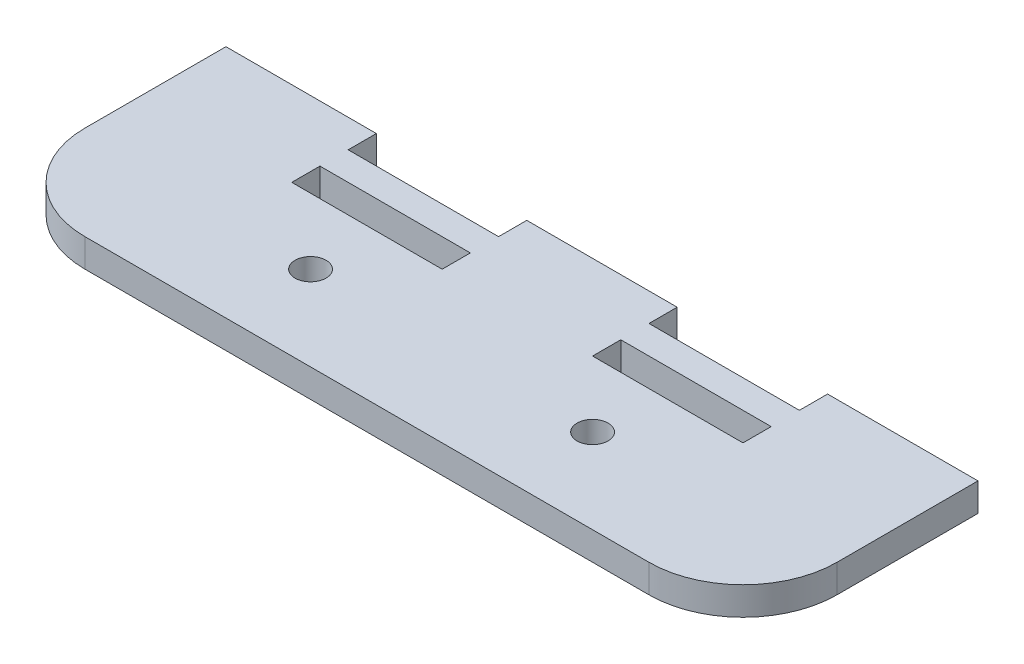
ISO-10303-21;
HEADER;
FILE_DESCRIPTION(('STEP AP214'),'2;1');
FILE_NAME('part.step','',(''),(''),'','','');
FILE_SCHEMA(('AUTOMOTIVE_DESIGN { 1 0 10303 214 1 1 1 1 }'));
ENDSEC;
DATA;
#1=APPLICATION_CONTEXT('core data for automotive mechanical design processes');
#2=APPLICATION_PROTOCOL_DEFINITION('international standard','automotive_design',2000,#1);
#3=PRODUCT_CONTEXT('',#1,'mechanical');
#4=PRODUCT('Part','Part','',(#3));
#5=PRODUCT_RELATED_PRODUCT_CATEGORY('part','',(#4));
#6=PRODUCT_DEFINITION_FORMATION('','',#4);
#7=PRODUCT_DEFINITION_CONTEXT('part definition',#1,'design');
#8=PRODUCT_DEFINITION('design','',#6,#7);
#9=PRODUCT_DEFINITION_SHAPE('','',#8);
#10=(LENGTH_UNIT() NAMED_UNIT(*) SI_UNIT(.MILLI.,.METRE.));
#11=(NAMED_UNIT(*) PLANE_ANGLE_UNIT() SI_UNIT($,.RADIAN.));
#12=(NAMED_UNIT(*) SI_UNIT($,.STERADIAN.) SOLID_ANGLE_UNIT());
#13=UNCERTAINTY_MEASURE_WITH_UNIT(LENGTH_MEASURE(1.E-05),#10,'distance_accuracy_value','');
#14=(GEOMETRIC_REPRESENTATION_CONTEXT(3) GLOBAL_UNCERTAINTY_ASSIGNED_CONTEXT((#13)) GLOBAL_UNIT_ASSIGNED_CONTEXT((#10,
#11,#12)) REPRESENTATION_CONTEXT('',''));
#15=CARTESIAN_POINT('',(0.,0.,0.));
#16=DIRECTION('',(0.,0.,1.));
#17=DIRECTION('',(1.,0.,0.));
#18=AXIS2_PLACEMENT_3D('',#15,#16,#17);
#19=CARTESIAN_POINT('',(-30.,3.,2.50000000000001));
#20=DIRECTION('',(0.,1.,0.));
#21=DIRECTION('',(0.,0.,1.));
#22=AXIS2_PLACEMENT_3D('',#19,#20,#21);
#23=PLANE('',#22);
#24=CARTESIAN_POINT('',(-15.,3.,3.5));
#25=DIRECTION('',(0.,1.,0.));
#26=DIRECTION('',(0.,0.,1.));
#27=AXIS2_PLACEMENT_3D('',#24,#25,#26);
#28=CIRCLE('',#27,1.65);
#29=CARTESIAN_POINT('',(-15.,3.,5.15));
#30=VERTEX_POINT('',#29);
#31=EDGE_CURVE('E257',#30,#30,#28,.T.);
#32=ORIENTED_EDGE('',*,*,#31,.F.);
#33=EDGE_LOOP('',(#32));
#34=FACE_BOUND('',#33,.T.);
#35=DIRECTION('',(-1.,0.,0.));
#36=VECTOR('',#35,1.);
#37=CARTESIAN_POINT('',(-24.,3.,-12.5));
#38=LINE('',#37,#36);
#39=CARTESIAN_POINT('',(-24.,3.,-12.5));
#40=VERTEX_POINT('',#39);
#41=CARTESIAN_POINT('',(-40.,3.,-12.5));
#42=VERTEX_POINT('',#41);
#43=EDGE_CURVE('E263',#40,#42,#38,.T.);
#44=ORIENTED_EDGE('',*,*,#43,.T.);
#45=DIRECTION('',(0.,0.,1.));
#46=VECTOR('',#45,1.);
#47=CARTESIAN_POINT('',(-40.,3.,2.49999999999994));
#48=LINE('',#47,#46);
#49=CARTESIAN_POINT('',(-40.,3.,2.49999999999994));
#50=VERTEX_POINT('',#49);
#51=EDGE_CURVE('E266',#42,#50,#48,.T.);
#52=ORIENTED_EDGE('',*,*,#51,.T.);
#53=CARTESIAN_POINT('',(-30.,3.,2.50000000000001));
#54=DIRECTION('',(0.,1.,0.));
#55=DIRECTION('',(0.,0.,1.));
#56=AXIS2_PLACEMENT_3D('',#53,#54,#55);
#57=CIRCLE('',#56,10.);
#58=CARTESIAN_POINT('',(-30.,3.,12.5));
#59=VERTEX_POINT('',#58);
#60=EDGE_CURVE('E269',#50,#59,#57,.T.);
#61=ORIENTED_EDGE('',*,*,#60,.T.);
#62=DIRECTION('',(1.,0.,0.));
#63=VECTOR('',#62,1.);
#64=CARTESIAN_POINT('',(29.9999999999999,3.,12.5));
#65=LINE('',#64,#63);
#66=CARTESIAN_POINT('',(29.9999999999999,3.,12.5));
#67=VERTEX_POINT('',#66);
#68=EDGE_CURVE('E271',#59,#67,#65,.T.);
#69=ORIENTED_EDGE('',*,*,#68,.T.);
#70=CARTESIAN_POINT('',(30.,3.,2.5));
#71=DIRECTION('',(0.,1.,0.));
#72=DIRECTION('',(0.,0.,-1.));
#73=AXIS2_PLACEMENT_3D('',#70,#71,#72);
#74=CIRCLE('',#73,10.);
#75=CARTESIAN_POINT('',(40.,3.,2.49999999999993));
#76=VERTEX_POINT('',#75);
#77=EDGE_CURVE('E273',#67,#76,#74,.T.);
#78=ORIENTED_EDGE('',*,*,#77,.T.);
#79=DIRECTION('',(0.,0.,-1.));
#80=VECTOR('',#79,1.);
#81=CARTESIAN_POINT('',(40.,3.,2.49999999999993));
#82=LINE('',#81,#80);
#83=CARTESIAN_POINT('',(40.,3.,-12.5));
#84=VERTEX_POINT('',#83);
#85=EDGE_CURVE('E275',#76,#84,#82,.T.);
#86=ORIENTED_EDGE('',*,*,#85,.T.);
#87=DIRECTION('',(-1.,0.,0.));
#88=VECTOR('',#87,1.);
#89=CARTESIAN_POINT('',(40.,3.,-12.5));
#90=LINE('',#89,#88);
#91=CARTESIAN_POINT('',(24.,3.,-12.5));
#92=VERTEX_POINT('',#91);
#93=EDGE_CURVE('E277',#84,#92,#90,.T.);
#94=ORIENTED_EDGE('',*,*,#93,.T.);
#95=DIRECTION('',(0.,0.,1.));
#96=VECTOR('',#95,1.);
#97=CARTESIAN_POINT('',(24.,3.,-9.5));
#98=LINE('',#97,#96);
#99=CARTESIAN_POINT('',(24.,3.,-9.5));
#100=VERTEX_POINT('',#99);
#101=EDGE_CURVE('E279',#92,#100,#98,.T.);
#102=ORIENTED_EDGE('',*,*,#101,.T.);
#103=DIRECTION('',(-1.,0.,0.));
#104=VECTOR('',#103,1.);
#105=CARTESIAN_POINT('',(24.,3.,-9.5));
#106=LINE('',#105,#104);
#107=CARTESIAN_POINT('',(8.,3.,-9.5));
#108=VERTEX_POINT('',#107);
#109=EDGE_CURVE('E281',#100,#108,#106,.T.);
#110=ORIENTED_EDGE('',*,*,#109,.T.);
#111=DIRECTION('',(0.,0.,-1.));
#112=VECTOR('',#111,1.);
#113=CARTESIAN_POINT('',(8.,3.,-9.5));
#114=LINE('',#113,#112);
#115=CARTESIAN_POINT('',(8.,3.,-12.5));
#116=VERTEX_POINT('',#115);
#117=EDGE_CURVE('E283',#108,#116,#114,.T.);
#118=ORIENTED_EDGE('',*,*,#117,.T.);
#119=DIRECTION('',(-1.,0.,0.));
#120=VECTOR('',#119,1.);
#121=CARTESIAN_POINT('',(8.,3.,-12.5));
#122=LINE('',#121,#120);
#123=CARTESIAN_POINT('',(-8.,3.,-12.5));
#124=VERTEX_POINT('',#123);
#125=EDGE_CURVE('E285',#116,#124,#122,.T.);
#126=ORIENTED_EDGE('',*,*,#125,.T.);
#127=DIRECTION('',(0.,0.,1.));
#128=VECTOR('',#127,1.);
#129=CARTESIAN_POINT('',(-8.,3.,-9.49999999999999));
#130=LINE('',#129,#128);
#131=CARTESIAN_POINT('',(-8.,3.,-9.49999999999999));
#132=VERTEX_POINT('',#131);
#133=EDGE_CURVE('E287',#124,#132,#130,.T.);
#134=ORIENTED_EDGE('',*,*,#133,.T.);
#135=DIRECTION('',(-1.,0.,0.));
#136=VECTOR('',#135,1.);
#137=CARTESIAN_POINT('',(-24.,3.,-9.49999999999999));
#138=LINE('',#137,#136);
#139=CARTESIAN_POINT('',(-24.,3.,-9.49999999999999));
#140=VERTEX_POINT('',#139);
#141=EDGE_CURVE('E289',#132,#140,#138,.T.);
#142=ORIENTED_EDGE('',*,*,#141,.T.);
#143=DIRECTION('',(0.,0.,-1.));
#144=VECTOR('',#143,1.);
#145=CARTESIAN_POINT('',(-24.,3.,-9.49999999999999));
#146=LINE('',#145,#144);
#147=EDGE_CURVE('E291',#140,#40,#146,.T.);
#148=ORIENTED_EDGE('',*,*,#147,.T.);
#149=EDGE_LOOP('',(#44,#52,#61,#69,#78,#86,#94,#102,#110,#118,#126,#134,#142,#148));
#150=FACE_BOUND('',#149,.T.);
#151=CARTESIAN_POINT('',(15.,3.,3.5));
#152=DIRECTION('',(0.,1.,0.));
#153=DIRECTION('',(0.,0.,1.));
#154=AXIS2_PLACEMENT_3D('',#151,#152,#153);
#155=CIRCLE('',#154,1.65);
#156=CARTESIAN_POINT('',(15.,3.,5.15));
#157=VERTEX_POINT('',#156);
#158=EDGE_CURVE('E251',#157,#157,#155,.T.);
#159=ORIENTED_EDGE('',*,*,#158,.F.);
#160=EDGE_LOOP('',(#159));
#161=FACE_BOUND('',#160,.T.);
#162=DIRECTION('',(-1.,0.,0.));
#163=VECTOR('',#162,1.);
#164=CARTESIAN_POINT('',(-24.,3.,-6.49999999999999));
#165=LINE('',#164,#163);
#166=CARTESIAN_POINT('',(-8.,3.,-6.49999999999999));
#167=VERTEX_POINT('',#166);
#168=CARTESIAN_POINT('',(-24.,3.,-6.49999999999999));
#169=VERTEX_POINT('',#168);
#170=EDGE_CURVE('E222',#167,#169,#165,.T.);
#171=ORIENTED_EDGE('',*,*,#170,.F.);
#172=DIRECTION('',(0.,0.,-1.));
#173=VECTOR('',#172,1.);
#174=CARTESIAN_POINT('',(-8.,3.,-3.49999999999999));
#175=LINE('',#174,#173);
#176=CARTESIAN_POINT('',(-8.,3.,-3.49999999999999));
#177=VERTEX_POINT('',#176);
#178=EDGE_CURVE('E220',#177,#167,#175,.T.);
#179=ORIENTED_EDGE('',*,*,#178,.F.);
#180=DIRECTION('',(1.,0.,0.));
#181=VECTOR('',#180,1.);
#182=CARTESIAN_POINT('',(-24.,3.,-3.49999999999999));
#183=LINE('',#182,#181);
#184=CARTESIAN_POINT('',(-24.,3.,-3.49999999999999));
#185=VERTEX_POINT('',#184);
#186=EDGE_CURVE('E228',#185,#177,#183,.T.);
#187=ORIENTED_EDGE('',*,*,#186,.F.);
#188=DIRECTION('',(0.,0.,1.));
#189=VECTOR('',#188,1.);
#190=CARTESIAN_POINT('',(-24.,3.,-6.49999999999999));
#191=LINE('',#190,#189);
#192=EDGE_CURVE('E225',#169,#185,#191,.T.);
#193=ORIENTED_EDGE('',*,*,#192,.F.);
#194=EDGE_LOOP('',(#171,#179,#187,#193));
#195=FACE_BOUND('',#194,.T.);
#196=DIRECTION('',(0.,0.,-1.));
#197=VECTOR('',#196,1.);
#198=CARTESIAN_POINT('',(24.,3.,-3.49999999999999));
#199=LINE('',#198,#197);
#200=CARTESIAN_POINT('',(24.,3.,-3.49999999999999));
#201=VERTEX_POINT('',#200);
#202=CARTESIAN_POINT('',(24.,3.,-6.49999999999999));
#203=VERTEX_POINT('',#202);
#204=EDGE_CURVE('E192',#201,#203,#199,.T.);
#205=ORIENTED_EDGE('',*,*,#204,.F.);
#206=DIRECTION('',(1.,0.,0.));
#207=VECTOR('',#206,1.);
#208=CARTESIAN_POINT('',(8.,3.,-3.49999999999999));
#209=LINE('',#208,#207);
#210=CARTESIAN_POINT('',(8.,3.,-3.49999999999999));
#211=VERTEX_POINT('',#210);
#212=EDGE_CURVE('E184',#211,#201,#209,.T.);
#213=ORIENTED_EDGE('',*,*,#212,.F.);
#214=DIRECTION('',(0.,0.,1.));
#215=VECTOR('',#214,1.);
#216=CARTESIAN_POINT('',(8.,3.,-6.49999999999999));
#217=LINE('',#216,#215);
#218=CARTESIAN_POINT('',(8.,3.,-6.49999999999999));
#219=VERTEX_POINT('',#218);
#220=EDGE_CURVE('E206',#219,#211,#217,.T.);
#221=ORIENTED_EDGE('',*,*,#220,.F.);
#222=DIRECTION('',(-1.,0.,0.));
#223=VECTOR('',#222,1.);
#224=CARTESIAN_POINT('',(8.,3.,-6.49999999999999));
#225=LINE('',#224,#223);
#226=EDGE_CURVE('E204',#203,#219,#225,.T.);
#227=ORIENTED_EDGE('',*,*,#226,.F.);
#228=EDGE_LOOP('',(#205,#213,#221,#227));
#229=FACE_BOUND('',#228,.T.);
#230=ADVANCED_FACE('F35',(#34,#150,#161,#195,#229),#23,.T.);
#231=CARTESIAN_POINT('',(-30.,0.,2.50000000000001));
#232=DIRECTION('',(0.,1.,0.));
#233=DIRECTION('',(0.,0.,1.));
#234=AXIS2_PLACEMENT_3D('',#231,#232,#233);
#235=PLANE('',#234);
#236=DIRECTION('',(0.,0.,-1.));
#237=VECTOR('',#236,1.);
#238=CARTESIAN_POINT('',(-8.,0.,-3.49999999999999));
#239=LINE('',#238,#237);
#240=CARTESIAN_POINT('',(-8.,0.,-3.49999999999999));
#241=VERTEX_POINT('',#240);
#242=CARTESIAN_POINT('',(-8.,0.,-6.49999999999999));
#243=VERTEX_POINT('',#242);
#244=EDGE_CURVE('E200',#241,#243,#239,.T.);
#245=ORIENTED_EDGE('',*,*,#244,.T.);
#246=DIRECTION('',(-1.,0.,0.));
#247=VECTOR('',#246,1.);
#248=CARTESIAN_POINT('',(-24.,0.,-6.49999999999999));
#249=LINE('',#248,#247);
#250=CARTESIAN_POINT('',(-24.,0.,-6.49999999999999));
#251=VERTEX_POINT('',#250);
#252=EDGE_CURVE('E233',#243,#251,#249,.T.);
#253=ORIENTED_EDGE('',*,*,#252,.T.);
#254=DIRECTION('',(0.,0.,1.));
#255=VECTOR('',#254,1.);
#256=CARTESIAN_POINT('',(-24.,0.,-6.49999999999999));
#257=LINE('',#256,#255);
#258=CARTESIAN_POINT('',(-24.,0.,-3.49999999999999));
#259=VERTEX_POINT('',#258);
#260=EDGE_CURVE('E236',#251,#259,#257,.T.);
#261=ORIENTED_EDGE('',*,*,#260,.T.);
#262=DIRECTION('',(1.,0.,0.));
#263=VECTOR('',#262,1.);
#264=CARTESIAN_POINT('',(-24.,0.,-3.49999999999999));
#265=LINE('',#264,#263);
#266=EDGE_CURVE('E223',#259,#241,#265,.T.);
#267=ORIENTED_EDGE('',*,*,#266,.T.);
#268=EDGE_LOOP('',(#245,#253,#261,#267));
#269=FACE_BOUND('',#268,.T.);
#270=DIRECTION('',(-1.,0.,0.));
#271=VECTOR('',#270,1.);
#272=CARTESIAN_POINT('',(-24.,0.,-12.5));
#273=LINE('',#272,#271);
#274=CARTESIAN_POINT('',(-24.,0.,-12.5));
#275=VERTEX_POINT('',#274);
#276=CARTESIAN_POINT('',(-40.,0.,-12.5));
#277=VERTEX_POINT('',#276);
#278=EDGE_CURVE('E260',#275,#277,#273,.T.);
#279=ORIENTED_EDGE('',*,*,#278,.F.);
#280=DIRECTION('',(0.,0.,-1.));
#281=VECTOR('',#280,1.);
#282=CARTESIAN_POINT('',(-24.,0.,-9.49999999999999));
#283=LINE('',#282,#281);
#284=CARTESIAN_POINT('',(-24.,0.,-9.49999999999999));
#285=VERTEX_POINT('',#284);
#286=EDGE_CURVE('E267',#285,#275,#283,.T.);
#287=ORIENTED_EDGE('',*,*,#286,.F.);
#288=DIRECTION('',(-1.,0.,0.));
#289=VECTOR('',#288,1.);
#290=CARTESIAN_POINT('',(-24.,0.,-9.49999999999999));
#291=LINE('',#290,#289);
#292=CARTESIAN_POINT('',(-8.,0.,-9.49999999999999));
#293=VERTEX_POINT('',#292);
#294=EDGE_CURVE('E318',#293,#285,#291,.T.);
#295=ORIENTED_EDGE('',*,*,#294,.F.);
#296=DIRECTION('',(0.,0.,1.));
#297=VECTOR('',#296,1.);
#298=CARTESIAN_POINT('',(-8.,0.,-9.49999999999999));
#299=LINE('',#298,#297);
#300=CARTESIAN_POINT('',(-8.,0.,-12.5));
#301=VERTEX_POINT('',#300);
#302=EDGE_CURVE('E316',#301,#293,#299,.T.);
#303=ORIENTED_EDGE('',*,*,#302,.F.);
#304=DIRECTION('',(-1.,0.,0.));
#305=VECTOR('',#304,1.);
#306=CARTESIAN_POINT('',(8.,0.,-12.5));
#307=LINE('',#306,#305);
#308=CARTESIAN_POINT('',(8.,0.,-12.5));
#309=VERTEX_POINT('',#308);
#310=EDGE_CURVE('E314',#309,#301,#307,.T.);
#311=ORIENTED_EDGE('',*,*,#310,.F.);
#312=DIRECTION('',(0.,0.,-1.));
#313=VECTOR('',#312,1.);
#314=CARTESIAN_POINT('',(8.,0.,-9.5));
#315=LINE('',#314,#313);
#316=CARTESIAN_POINT('',(8.,0.,-9.5));
#317=VERTEX_POINT('',#316);
#318=EDGE_CURVE('E312',#317,#309,#315,.T.);
#319=ORIENTED_EDGE('',*,*,#318,.F.);
#320=DIRECTION('',(-1.,0.,0.));
#321=VECTOR('',#320,1.);
#322=CARTESIAN_POINT('',(24.,0.,-9.5));
#323=LINE('',#322,#321);
#324=CARTESIAN_POINT('',(24.,0.,-9.5));
#325=VERTEX_POINT('',#324);
#326=EDGE_CURVE('E310',#325,#317,#323,.T.);
#327=ORIENTED_EDGE('',*,*,#326,.F.);
#328=DIRECTION('',(0.,0.,1.));
#329=VECTOR('',#328,1.);
#330=CARTESIAN_POINT('',(24.,0.,-9.5));
#331=LINE('',#330,#329);
#332=CARTESIAN_POINT('',(24.,0.,-12.5));
#333=VERTEX_POINT('',#332);
#334=EDGE_CURVE('E308',#333,#325,#331,.T.);
#335=ORIENTED_EDGE('',*,*,#334,.F.);
#336=DIRECTION('',(-1.,0.,0.));
#337=VECTOR('',#336,1.);
#338=CARTESIAN_POINT('',(40.,0.,-12.5));
#339=LINE('',#338,#337);
#340=CARTESIAN_POINT('',(40.,0.,-12.5));
#341=VERTEX_POINT('',#340);
#342=EDGE_CURVE('E306',#341,#333,#339,.T.);
#343=ORIENTED_EDGE('',*,*,#342,.F.);
#344=DIRECTION('',(0.,0.,-1.));
#345=VECTOR('',#344,1.);
#346=CARTESIAN_POINT('',(40.,0.,2.49999999999993));
#347=LINE('',#346,#345);
#348=CARTESIAN_POINT('',(40.,0.,2.49999999999993));
#349=VERTEX_POINT('',#348);
#350=EDGE_CURVE('E304',#349,#341,#347,.T.);
#351=ORIENTED_EDGE('',*,*,#350,.F.);
#352=CARTESIAN_POINT('',(30.,0.,2.5));
#353=DIRECTION('',(0.,1.,0.));
#354=DIRECTION('',(0.,0.,-1.));
#355=AXIS2_PLACEMENT_3D('',#352,#353,#354);
#356=CIRCLE('',#355,10.);
#357=CARTESIAN_POINT('',(29.9999999999999,0.,12.5));
#358=VERTEX_POINT('',#357);
#359=EDGE_CURVE('E302',#358,#349,#356,.T.);
#360=ORIENTED_EDGE('',*,*,#359,.F.);
#361=DIRECTION('',(1.,0.,0.));
#362=VECTOR('',#361,1.);
#363=CARTESIAN_POINT('',(29.9999999999999,0.,12.5));
#364=LINE('',#363,#362);
#365=CARTESIAN_POINT('',(-30.,0.,12.5));
#366=VERTEX_POINT('',#365);
#367=EDGE_CURVE('E300',#366,#358,#364,.T.);
#368=ORIENTED_EDGE('',*,*,#367,.F.);
#369=CARTESIAN_POINT('',(-30.,0.,2.50000000000001));
#370=DIRECTION('',(0.,1.,0.));
#371=DIRECTION('',(0.,0.,1.));
#372=AXIS2_PLACEMENT_3D('',#369,#370,#371);
#373=CIRCLE('',#372,10.);
#374=CARTESIAN_POINT('',(-40.,0.,2.49999999999994));
#375=VERTEX_POINT('',#374);
#376=EDGE_CURVE('E298',#375,#366,#373,.T.);
#377=ORIENTED_EDGE('',*,*,#376,.F.);
#378=DIRECTION('',(0.,0.,1.));
#379=VECTOR('',#378,1.);
#380=CARTESIAN_POINT('',(-40.,0.,2.49999999999994));
#381=LINE('',#380,#379);
#382=EDGE_CURVE('E296',#277,#375,#381,.T.);
#383=ORIENTED_EDGE('',*,*,#382,.F.);
#384=EDGE_LOOP('',(#279,#287,#295,#303,#311,#319,#327,#335,#343,#351,#360,#368,#377,#383));
#385=FACE_BOUND('',#384,.T.);
#386=CARTESIAN_POINT('',(-15.,0.,3.5));
#387=DIRECTION('',(0.,1.,0.));
#388=DIRECTION('',(0.,0.,1.));
#389=AXIS2_PLACEMENT_3D('',#386,#387,#388);
#390=CIRCLE('',#389,1.65);
#391=CARTESIAN_POINT('',(-15.,0.,5.15));
#392=VERTEX_POINT('',#391);
#393=EDGE_CURVE('E254',#392,#392,#390,.T.);
#394=ORIENTED_EDGE('',*,*,#393,.T.);
#395=EDGE_LOOP('',(#394));
#396=FACE_BOUND('',#395,.T.);
#397=CARTESIAN_POINT('',(15.,0.,3.5));
#398=DIRECTION('',(0.,1.,0.));
#399=DIRECTION('',(0.,0.,1.));
#400=AXIS2_PLACEMENT_3D('',#397,#398,#399);
#401=CIRCLE('',#400,1.65);
#402=CARTESIAN_POINT('',(15.,0.,5.15));
#403=VERTEX_POINT('',#402);
#404=EDGE_CURVE('E250',#403,#403,#401,.T.);
#405=ORIENTED_EDGE('',*,*,#404,.T.);
#406=EDGE_LOOP('',(#405));
#407=FACE_BOUND('',#406,.T.);
#408=DIRECTION('',(1.,0.,0.));
#409=VECTOR('',#408,1.);
#410=CARTESIAN_POINT('',(8.,0.,-3.49999999999999));
#411=LINE('',#410,#409);
#412=CARTESIAN_POINT('',(8.,0.,-3.49999999999999));
#413=VERTEX_POINT('',#412);
#414=CARTESIAN_POINT('',(24.,0.,-3.49999999999999));
#415=VERTEX_POINT('',#414);
#416=EDGE_CURVE('E58',#413,#415,#411,.T.);
#417=ORIENTED_EDGE('',*,*,#416,.T.);
#418=DIRECTION('',(0.,0.,-1.));
#419=VECTOR('',#418,1.);
#420=CARTESIAN_POINT('',(24.,0.,-3.49999999999999));
#421=LINE('',#420,#419);
#422=CARTESIAN_POINT('',(24.,0.,-6.49999999999999));
#423=VERTEX_POINT('',#422);
#424=EDGE_CURVE('E199',#415,#423,#421,.T.);
#425=ORIENTED_EDGE('',*,*,#424,.T.);
#426=DIRECTION('',(-1.,0.,0.));
#427=VECTOR('',#426,1.);
#428=CARTESIAN_POINT('',(8.,0.,-6.49999999999999));
#429=LINE('',#428,#427);
#430=CARTESIAN_POINT('',(8.,0.,-6.49999999999999));
#431=VERTEX_POINT('',#430);
#432=EDGE_CURVE('E212',#423,#431,#429,.T.);
#433=ORIENTED_EDGE('',*,*,#432,.T.);
#434=DIRECTION('',(0.,0.,1.));
#435=VECTOR('',#434,1.);
#436=CARTESIAN_POINT('',(8.,0.,-6.49999999999999));
#437=LINE('',#436,#435);
#438=EDGE_CURVE('E193',#431,#413,#437,.T.);
#439=ORIENTED_EDGE('',*,*,#438,.T.);
#440=EDGE_LOOP('',(#417,#425,#433,#439));
#441=FACE_BOUND('',#440,.T.);
#442=ADVANCED_FACE('F366',(#269,#385,#396,#407,#441),#235,.F.);
#443=CARTESIAN_POINT('',(-24.,3.,-12.5));
#444=DIRECTION('',(0.,0.,1.));
#445=DIRECTION('',(1.,0.,0.));
#446=AXIS2_PLACEMENT_3D('',#443,#444,#445);
#447=PLANE('',#446);
#448=ORIENTED_EDGE('',*,*,#278,.T.);
#449=DIRECTION('',(0.,-1.,0.));
#450=VECTOR('',#449,1.);
#451=CARTESIAN_POINT('',(-40.,3.,-12.5));
#452=LINE('',#451,#450);
#453=EDGE_CURVE('E11',#42,#277,#452,.T.);
#454=ORIENTED_EDGE('',*,*,#453,.F.);
#455=ORIENTED_EDGE('',*,*,#43,.F.);
#456=DIRECTION('',(0.,-1.,0.));
#457=VECTOR('',#456,1.);
#458=CARTESIAN_POINT('',(-24.,3.,-12.5));
#459=LINE('',#458,#457);
#460=EDGE_CURVE('E293',#40,#275,#459,.T.);
#461=ORIENTED_EDGE('',*,*,#460,.T.);
#462=EDGE_LOOP('',(#448,#454,#455,#461));
#463=FACE_BOUND('',#462,.T.);
#464=ADVANCED_FACE('F37',(#463),#447,.F.);
#465=CARTESIAN_POINT('',(-40.,3.,2.49999999999994));
#466=DIRECTION('',(1.,0.,0.));
#467=DIRECTION('',(0.,0.,-1.));
#468=AXIS2_PLACEMENT_3D('',#465,#466,#467);
#469=PLANE('',#468);
#470=ORIENTED_EDGE('',*,*,#382,.T.);
#471=DIRECTION('',(0.,-1.,0.));
#472=VECTOR('',#471,1.);
#473=CARTESIAN_POINT('',(-40.,3.,2.49999999999994));
#474=LINE('',#473,#472);
#475=EDGE_CURVE('E43',#50,#375,#474,.T.);
#476=ORIENTED_EDGE('',*,*,#475,.F.);
#477=ORIENTED_EDGE('',*,*,#51,.F.);
#478=ORIENTED_EDGE('',*,*,#453,.T.);
#479=EDGE_LOOP('',(#470,#476,#477,#478));
#480=FACE_BOUND('',#479,.T.);
#481=ADVANCED_FACE('F384',(#480),#469,.F.);
#482=CARTESIAN_POINT('',(-30.,3.,2.50000000000001));
#483=DIRECTION('',(0.,-1.,0.));
#484=DIRECTION('',(0.,0.,-1.));
#485=AXIS2_PLACEMENT_3D('',#482,#483,#484);
#486=CYLINDRICAL_SURFACE('',#485,10.);
#487=ORIENTED_EDGE('',*,*,#376,.T.);
#488=DIRECTION('',(0.,-1.,0.));
#489=VECTOR('',#488,1.);
#490=CARTESIAN_POINT('',(-30.,3.,12.5));
#491=LINE('',#490,#489);
#492=EDGE_CURVE('E353',#59,#366,#491,.T.);
#493=ORIENTED_EDGE('',*,*,#492,.F.);
#494=ORIENTED_EDGE('',*,*,#60,.F.);
#495=ORIENTED_EDGE('',*,*,#475,.T.);
#496=EDGE_LOOP('',(#487,#493,#494,#495));
#497=FACE_BOUND('',#496,.T.);
#498=ADVANCED_FACE('F360',(#497),#486,.T.);
#499=CARTESIAN_POINT('',(29.9999999999999,3.,12.5));
#500=DIRECTION('',(0.,0.,-1.));
#501=DIRECTION('',(-1.,0.,0.));
#502=AXIS2_PLACEMENT_3D('',#499,#500,#501);
#503=PLANE('',#502);
#504=ORIENTED_EDGE('',*,*,#367,.T.);
#505=DIRECTION('',(0.,-1.,0.));
#506=VECTOR('',#505,1.);
#507=CARTESIAN_POINT('',(29.9999999999999,3.,12.5));
#508=LINE('',#507,#506);
#509=EDGE_CURVE('E350',#67,#358,#508,.T.);
#510=ORIENTED_EDGE('',*,*,#509,.F.);
#511=ORIENTED_EDGE('',*,*,#68,.F.);
#512=ORIENTED_EDGE('',*,*,#492,.T.);
#513=EDGE_LOOP('',(#504,#510,#511,#512));
#514=FACE_BOUND('',#513,.T.);
#515=ADVANCED_FACE('F372',(#514),#503,.F.);
#516=CARTESIAN_POINT('',(30.,3.,2.5));
#517=DIRECTION('',(0.,-1.,0.));
#518=DIRECTION('',(0.,0.,-1.));
#519=AXIS2_PLACEMENT_3D('',#516,#517,#518);
#520=CYLINDRICAL_SURFACE('',#519,10.);
#521=ORIENTED_EDGE('',*,*,#359,.T.);
#522=DIRECTION('',(0.,-1.,0.));
#523=VECTOR('',#522,1.);
#524=CARTESIAN_POINT('',(40.,3.,2.49999999999993));
#525=LINE('',#524,#523);
#526=EDGE_CURVE('E347',#76,#349,#525,.T.);
#527=ORIENTED_EDGE('',*,*,#526,.F.);
#528=ORIENTED_EDGE('',*,*,#77,.F.);
#529=ORIENTED_EDGE('',*,*,#509,.T.);
#530=EDGE_LOOP('',(#521,#527,#528,#529));
#531=FACE_BOUND('',#530,.T.);
#532=ADVANCED_FACE('F376',(#531),#520,.T.);
#533=CARTESIAN_POINT('',(40.,3.,2.49999999999993));
#534=DIRECTION('',(-1.,0.,0.));
#535=DIRECTION('',(0.,0.,1.));
#536=AXIS2_PLACEMENT_3D('',#533,#534,#535);
#537=PLANE('',#536);
#538=ORIENTED_EDGE('',*,*,#350,.T.);
#539=DIRECTION('',(0.,-1.,0.));
#540=VECTOR('',#539,1.);
#541=CARTESIAN_POINT('',(40.,3.,-12.5));
#542=LINE('',#541,#540);
#543=EDGE_CURVE('E344',#84,#341,#542,.T.);
#544=ORIENTED_EDGE('',*,*,#543,.F.);
#545=ORIENTED_EDGE('',*,*,#85,.F.);
#546=ORIENTED_EDGE('',*,*,#526,.T.);
#547=EDGE_LOOP('',(#538,#544,#545,#546));
#548=FACE_BOUND('',#547,.T.);
#549=ADVANCED_FACE('F427',(#548),#537,.F.);
#550=CARTESIAN_POINT('',(40.,3.,-12.5));
#551=DIRECTION('',(0.,0.,1.));
#552=DIRECTION('',(1.,0.,0.));
#553=AXIS2_PLACEMENT_3D('',#550,#551,#552);
#554=PLANE('',#553);
#555=ORIENTED_EDGE('',*,*,#342,.T.);
#556=DIRECTION('',(0.,-1.,0.));
#557=VECTOR('',#556,1.);
#558=CARTESIAN_POINT('',(24.,3.,-12.5));
#559=LINE('',#558,#557);
#560=EDGE_CURVE('E341',#92,#333,#559,.T.);
#561=ORIENTED_EDGE('',*,*,#560,.F.);
#562=ORIENTED_EDGE('',*,*,#93,.F.);
#563=ORIENTED_EDGE('',*,*,#543,.T.);
#564=EDGE_LOOP('',(#555,#561,#562,#563));
#565=FACE_BOUND('',#564,.T.);
#566=ADVANCED_FACE('F425',(#565),#554,.F.);
#567=CARTESIAN_POINT('',(24.,3.,-9.5));
#568=DIRECTION('',(1.,0.,0.));
#569=DIRECTION('',(0.,0.,-1.));
#570=AXIS2_PLACEMENT_3D('',#567,#568,#569);
#571=PLANE('',#570);
#572=ORIENTED_EDGE('',*,*,#334,.T.);
#573=DIRECTION('',(0.,-1.,0.));
#574=VECTOR('',#573,1.);
#575=CARTESIAN_POINT('',(24.,3.,-9.5));
#576=LINE('',#575,#574);
#577=EDGE_CURVE('E338',#100,#325,#576,.T.);
#578=ORIENTED_EDGE('',*,*,#577,.F.);
#579=ORIENTED_EDGE('',*,*,#101,.F.);
#580=ORIENTED_EDGE('',*,*,#560,.T.);
#581=EDGE_LOOP('',(#572,#578,#579,#580));
#582=FACE_BOUND('',#581,.T.);
#583=ADVANCED_FACE('F420',(#582),#571,.F.);
#584=CARTESIAN_POINT('',(24.,3.,-9.5));
#585=DIRECTION('',(0.,0.,1.));
#586=DIRECTION('',(1.,0.,0.));
#587=AXIS2_PLACEMENT_3D('',#584,#585,#586);
#588=PLANE('',#587);
#589=ORIENTED_EDGE('',*,*,#326,.T.);
#590=DIRECTION('',(0.,-1.,0.));
#591=VECTOR('',#590,1.);
#592=CARTESIAN_POINT('',(8.,3.,-9.5));
#593=LINE('',#592,#591);
#594=EDGE_CURVE('E335',#108,#317,#593,.T.);
#595=ORIENTED_EDGE('',*,*,#594,.F.);
#596=ORIENTED_EDGE('',*,*,#109,.F.);
#597=ORIENTED_EDGE('',*,*,#577,.T.);
#598=EDGE_LOOP('',(#589,#595,#596,#597));
#599=FACE_BOUND('',#598,.T.);
#600=ADVANCED_FACE('F415',(#599),#588,.F.);
#601=CARTESIAN_POINT('',(8.,3.,-9.5));
#602=DIRECTION('',(-1.,0.,0.));
#603=DIRECTION('',(0.,0.,1.));
#604=AXIS2_PLACEMENT_3D('',#601,#602,#603);
#605=PLANE('',#604);
#606=ORIENTED_EDGE('',*,*,#318,.T.);
#607=DIRECTION('',(0.,-1.,0.));
#608=VECTOR('',#607,1.);
#609=CARTESIAN_POINT('',(8.,3.,-12.5));
#610=LINE('',#609,#608);
#611=EDGE_CURVE('E332',#116,#309,#610,.T.);
#612=ORIENTED_EDGE('',*,*,#611,.F.);
#613=ORIENTED_EDGE('',*,*,#117,.F.);
#614=ORIENTED_EDGE('',*,*,#594,.T.);
#615=EDGE_LOOP('',(#606,#612,#613,#614));
#616=FACE_BOUND('',#615,.T.);
#617=ADVANCED_FACE('F411',(#616),#605,.F.);
#618=CARTESIAN_POINT('',(8.,3.,-12.5));
#619=DIRECTION('',(0.,0.,1.));
#620=DIRECTION('',(1.,0.,0.));
#621=AXIS2_PLACEMENT_3D('',#618,#619,#620);
#622=PLANE('',#621);
#623=ORIENTED_EDGE('',*,*,#310,.T.);
#624=DIRECTION('',(0.,-1.,0.));
#625=VECTOR('',#624,1.);
#626=CARTESIAN_POINT('',(-8.,3.,-12.5));
#627=LINE('',#626,#625);
#628=EDGE_CURVE('E329',#124,#301,#627,.T.);
#629=ORIENTED_EDGE('',*,*,#628,.F.);
#630=ORIENTED_EDGE('',*,*,#125,.F.);
#631=ORIENTED_EDGE('',*,*,#611,.T.);
#632=EDGE_LOOP('',(#623,#629,#630,#631));
#633=FACE_BOUND('',#632,.T.);
#634=ADVANCED_FACE('F406',(#633),#622,.F.);
#635=CARTESIAN_POINT('',(-8.,3.,-9.49999999999999));
#636=DIRECTION('',(1.,0.,0.));
#637=DIRECTION('',(0.,0.,-1.));
#638=AXIS2_PLACEMENT_3D('',#635,#636,#637);
#639=PLANE('',#638);
#640=ORIENTED_EDGE('',*,*,#302,.T.);
#641=DIRECTION('',(0.,-1.,0.));
#642=VECTOR('',#641,1.);
#643=CARTESIAN_POINT('',(-8.,3.,-9.49999999999999));
#644=LINE('',#643,#642);
#645=EDGE_CURVE('E326',#132,#293,#644,.T.);
#646=ORIENTED_EDGE('',*,*,#645,.F.);
#647=ORIENTED_EDGE('',*,*,#133,.F.);
#648=ORIENTED_EDGE('',*,*,#628,.T.);
#649=EDGE_LOOP('',(#640,#646,#647,#648));
#650=FACE_BOUND('',#649,.T.);
#651=ADVANCED_FACE('F400',(#650),#639,.F.);
#652=CARTESIAN_POINT('',(-24.,3.,-9.49999999999999));
#653=DIRECTION('',(0.,0.,1.));
#654=DIRECTION('',(1.,0.,0.));
#655=AXIS2_PLACEMENT_3D('',#652,#653,#654);
#656=PLANE('',#655);
#657=ORIENTED_EDGE('',*,*,#294,.T.);
#658=DIRECTION('',(0.,-1.,0.));
#659=VECTOR('',#658,1.);
#660=CARTESIAN_POINT('',(-24.,3.,-9.49999999999999));
#661=LINE('',#660,#659);
#662=EDGE_CURVE('E323',#140,#285,#661,.T.);
#663=ORIENTED_EDGE('',*,*,#662,.F.);
#664=ORIENTED_EDGE('',*,*,#141,.F.);
#665=ORIENTED_EDGE('',*,*,#645,.T.);
#666=EDGE_LOOP('',(#657,#663,#664,#665));
#667=FACE_BOUND('',#666,.T.);
#668=ADVANCED_FACE('F396',(#667),#656,.F.);
#669=CARTESIAN_POINT('',(-24.,3.,-9.49999999999999));
#670=DIRECTION('',(-1.,0.,0.));
#671=DIRECTION('',(0.,0.,1.));
#672=AXIS2_PLACEMENT_3D('',#669,#670,#671);
#673=PLANE('',#672);
#674=ORIENTED_EDGE('',*,*,#286,.T.);
#675=ORIENTED_EDGE('',*,*,#460,.F.);
#676=ORIENTED_EDGE('',*,*,#147,.F.);
#677=ORIENTED_EDGE('',*,*,#662,.T.);
#678=EDGE_LOOP('',(#674,#675,#676,#677));
#679=FACE_BOUND('',#678,.T.);
#680=ADVANCED_FACE('F391',(#679),#673,.F.);
#681=CARTESIAN_POINT('',(-15.,3.,3.5));
#682=DIRECTION('',(0.,-1.,0.));
#683=DIRECTION('',(0.,0.,-1.));
#684=AXIS2_PLACEMENT_3D('',#681,#682,#683);
#685=CYLINDRICAL_SURFACE('',#684,1.65);
#686=ORIENTED_EDGE('',*,*,#31,.T.);
#687=EDGE_LOOP('',(#686));
#688=FACE_BOUND('',#687,.T.);
#689=ORIENTED_EDGE('',*,*,#393,.F.);
#690=EDGE_LOOP('',(#689));
#691=FACE_BOUND('',#690,.T.);
#692=ADVANCED_FACE('F446',(#688,#691),#685,.F.);
#693=CARTESIAN_POINT('',(15.,3.,3.5));
#694=DIRECTION('',(0.,-1.,0.));
#695=DIRECTION('',(0.,0.,-1.));
#696=AXIS2_PLACEMENT_3D('',#693,#694,#695);
#697=CYLINDRICAL_SURFACE('',#696,1.65);
#698=ORIENTED_EDGE('',*,*,#158,.T.);
#699=EDGE_LOOP('',(#698));
#700=FACE_BOUND('',#699,.T.);
#701=ORIENTED_EDGE('',*,*,#404,.F.);
#702=EDGE_LOOP('',(#701));
#703=FACE_BOUND('',#702,.T.);
#704=ADVANCED_FACE('F496',(#700,#703),#697,.F.);
#705=CARTESIAN_POINT('',(-8.,3.,-3.49999999999999));
#706=DIRECTION('',(-1.,0.,0.));
#707=DIRECTION('',(0.,0.,1.));
#708=AXIS2_PLACEMENT_3D('',#705,#706,#707);
#709=PLANE('',#708);
#710=ORIENTED_EDGE('',*,*,#244,.F.);
#711=DIRECTION('',(0.,-1.,0.));
#712=VECTOR('',#711,1.);
#713=CARTESIAN_POINT('',(-8.,3.,-3.49999999999999));
#714=LINE('',#713,#712);
#715=EDGE_CURVE('E230',#177,#241,#714,.T.);
#716=ORIENTED_EDGE('',*,*,#715,.F.);
#717=ORIENTED_EDGE('',*,*,#178,.T.);
#718=DIRECTION('',(0.,-1.,0.));
#719=VECTOR('',#718,1.);
#720=CARTESIAN_POINT('',(-8.,3.,-6.49999999999999));
#721=LINE('',#720,#719);
#722=EDGE_CURVE('E247',#167,#243,#721,.T.);
#723=ORIENTED_EDGE('',*,*,#722,.T.);
#724=EDGE_LOOP('',(#710,#716,#717,#723));
#725=FACE_BOUND('',#724,.T.);
#726=ADVANCED_FACE('F503',(#725),#709,.T.);
#727=CARTESIAN_POINT('',(-24.,3.,-6.49999999999999));
#728=DIRECTION('',(0.,0.,1.));
#729=DIRECTION('',(1.,0.,0.));
#730=AXIS2_PLACEMENT_3D('',#727,#728,#729);
#731=PLANE('',#730);
#732=ORIENTED_EDGE('',*,*,#252,.F.);
#733=ORIENTED_EDGE('',*,*,#722,.F.);
#734=ORIENTED_EDGE('',*,*,#170,.T.);
#735=DIRECTION('',(0.,-1.,0.));
#736=VECTOR('',#735,1.);
#737=CARTESIAN_POINT('',(-24.,3.,-6.49999999999999));
#738=LINE('',#737,#736);
#739=EDGE_CURVE('E245',#169,#251,#738,.T.);
#740=ORIENTED_EDGE('',*,*,#739,.T.);
#741=EDGE_LOOP('',(#732,#733,#734,#740));
#742=FACE_BOUND('',#741,.T.);
#743=ADVANCED_FACE('F510',(#742),#731,.T.);
#744=CARTESIAN_POINT('',(-24.,3.,-6.49999999999999));
#745=DIRECTION('',(1.,0.,0.));
#746=DIRECTION('',(0.,0.,-1.));
#747=AXIS2_PLACEMENT_3D('',#744,#745,#746);
#748=PLANE('',#747);
#749=ORIENTED_EDGE('',*,*,#260,.F.);
#750=ORIENTED_EDGE('',*,*,#739,.F.);
#751=ORIENTED_EDGE('',*,*,#192,.T.);
#752=DIRECTION('',(0.,-1.,0.));
#753=VECTOR('',#752,1.);
#754=CARTESIAN_POINT('',(-24.,3.,-3.49999999999999));
#755=LINE('',#754,#753);
#756=EDGE_CURVE('E243',#185,#259,#755,.T.);
#757=ORIENTED_EDGE('',*,*,#756,.T.);
#758=EDGE_LOOP('',(#749,#750,#751,#757));
#759=FACE_BOUND('',#758,.T.);
#760=ADVANCED_FACE('F518',(#759),#748,.T.);
#761=CARTESIAN_POINT('',(-24.,3.,-3.49999999999999));
#762=DIRECTION('',(0.,0.,-1.));
#763=DIRECTION('',(-1.,0.,0.));
#764=AXIS2_PLACEMENT_3D('',#761,#762,#763);
#765=PLANE('',#764);
#766=ORIENTED_EDGE('',*,*,#266,.F.);
#767=ORIENTED_EDGE('',*,*,#756,.F.);
#768=ORIENTED_EDGE('',*,*,#186,.T.);
#769=ORIENTED_EDGE('',*,*,#715,.T.);
#770=EDGE_LOOP('',(#766,#767,#768,#769));
#771=FACE_BOUND('',#770,.T.);
#772=ADVANCED_FACE('F526',(#771),#765,.T.);
#773=CARTESIAN_POINT('',(8.,3.,-3.49999999999999));
#774=DIRECTION('',(0.,0.,-1.));
#775=DIRECTION('',(-1.,0.,0.));
#776=AXIS2_PLACEMENT_3D('',#773,#774,#775);
#777=PLANE('',#776);
#778=ORIENTED_EDGE('',*,*,#416,.F.);
#779=DIRECTION('',(0.,-1.,0.));
#780=VECTOR('',#779,1.);
#781=CARTESIAN_POINT('',(8.,3.,-3.49999999999999));
#782=LINE('',#781,#780);
#783=EDGE_CURVE('E188',#211,#413,#782,.T.);
#784=ORIENTED_EDGE('',*,*,#783,.F.);
#785=ORIENTED_EDGE('',*,*,#212,.T.);
#786=DIRECTION('',(0.,-1.,0.));
#787=VECTOR('',#786,1.);
#788=CARTESIAN_POINT('',(24.,3.,-3.49999999999999));
#789=LINE('',#788,#787);
#790=EDGE_CURVE('E187',#201,#415,#789,.T.);
#791=ORIENTED_EDGE('',*,*,#790,.T.);
#792=EDGE_LOOP('',(#778,#784,#785,#791));
#793=FACE_BOUND('',#792,.T.);
#794=ADVANCED_FACE('F186',(#793),#777,.T.);
#795=CARTESIAN_POINT('',(24.,3.,-3.49999999999999));
#796=DIRECTION('',(-1.,0.,0.));
#797=DIRECTION('',(0.,0.,1.));
#798=AXIS2_PLACEMENT_3D('',#795,#796,#797);
#799=PLANE('',#798);
#800=ORIENTED_EDGE('',*,*,#424,.F.);
#801=ORIENTED_EDGE('',*,*,#790,.F.);
#802=ORIENTED_EDGE('',*,*,#204,.T.);
#803=DIRECTION('',(0.,-1.,0.));
#804=VECTOR('',#803,1.);
#805=CARTESIAN_POINT('',(24.,3.,-6.49999999999999));
#806=LINE('',#805,#804);
#807=EDGE_CURVE('E201',#203,#423,#806,.T.);
#808=ORIENTED_EDGE('',*,*,#807,.T.);
#809=EDGE_LOOP('',(#800,#801,#802,#808));
#810=FACE_BOUND('',#809,.T.);
#811=ADVANCED_FACE('F196',(#810),#799,.T.);
#812=CARTESIAN_POINT('',(8.,3.,-6.49999999999999));
#813=DIRECTION('',(0.,0.,1.));
#814=DIRECTION('',(1.,0.,0.));
#815=AXIS2_PLACEMENT_3D('',#812,#813,#814);
#816=PLANE('',#815);
#817=ORIENTED_EDGE('',*,*,#432,.F.);
#818=ORIENTED_EDGE('',*,*,#807,.F.);
#819=ORIENTED_EDGE('',*,*,#226,.T.);
#820=DIRECTION('',(0.,-1.,0.));
#821=VECTOR('',#820,1.);
#822=CARTESIAN_POINT('',(8.,3.,-6.49999999999999));
#823=LINE('',#822,#821);
#824=EDGE_CURVE('E50',#219,#431,#823,.T.);
#825=ORIENTED_EDGE('',*,*,#824,.T.);
#826=EDGE_LOOP('',(#817,#818,#819,#825));
#827=FACE_BOUND('',#826,.T.);
#828=ADVANCED_FACE('F547',(#827),#816,.T.);
#829=CARTESIAN_POINT('',(8.,3.,-6.49999999999999));
#830=DIRECTION('',(1.,0.,0.));
#831=DIRECTION('',(0.,0.,-1.));
#832=AXIS2_PLACEMENT_3D('',#829,#830,#831);
#833=PLANE('',#832);
#834=ORIENTED_EDGE('',*,*,#438,.F.);
#835=ORIENTED_EDGE('',*,*,#824,.F.);
#836=ORIENTED_EDGE('',*,*,#220,.T.);
#837=ORIENTED_EDGE('',*,*,#783,.T.);
#838=EDGE_LOOP('',(#834,#835,#836,#837));
#839=FACE_BOUND('',#838,.T.);
#840=ADVANCED_FACE('F554',(#839),#833,.T.);
#841=CLOSED_SHELL('',(#230,#442,#464,#481,#498,#515,#532,#549,#566,#583,#600,#617,#634,#651,
#668,#680,#692,#704,#726,#743,#760,#772,#794,#811,#828,#840));
#842=MANIFOLD_SOLID_BREP('B2',#841);
#843=ADVANCED_BREP_SHAPE_REPRESENTATION('',(#18,#842),#14);
#844=SHAPE_DEFINITION_REPRESENTATION(#9,#843);
ENDSEC;
END-ISO-10303-21;
